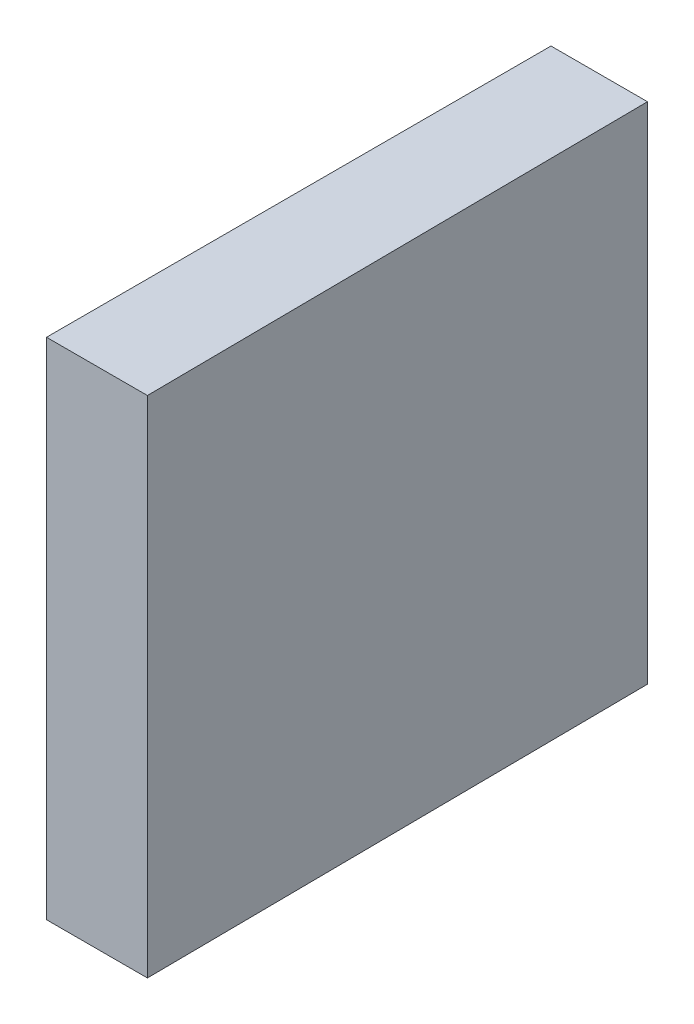
ISO-10303-21;
HEADER;
FILE_DESCRIPTION(('STEP AP214'),'2;1');
FILE_NAME('part.step','',(''),(''),'','','');
FILE_SCHEMA(('AUTOMOTIVE_DESIGN { 1 0 10303 214 1 1 1 1 }'));
ENDSEC;
DATA;
#1=APPLICATION_CONTEXT('core data for automotive mechanical design processes');
#2=APPLICATION_PROTOCOL_DEFINITION('international standard','automotive_design',2000,#1);
#3=PRODUCT_CONTEXT('',#1,'mechanical');
#4=PRODUCT('Part','Part','',(#3));
#5=PRODUCT_RELATED_PRODUCT_CATEGORY('part','',(#4));
#6=PRODUCT_DEFINITION_FORMATION('','',#4);
#7=PRODUCT_DEFINITION_CONTEXT('part definition',#1,'design');
#8=PRODUCT_DEFINITION('design','',#6,#7);
#9=PRODUCT_DEFINITION_SHAPE('','',#8);
#10=(LENGTH_UNIT() NAMED_UNIT(*) SI_UNIT(.MILLI.,.METRE.));
#11=(NAMED_UNIT(*) PLANE_ANGLE_UNIT() SI_UNIT($,.RADIAN.));
#12=(NAMED_UNIT(*) SI_UNIT($,.STERADIAN.) SOLID_ANGLE_UNIT());
#13=UNCERTAINTY_MEASURE_WITH_UNIT(LENGTH_MEASURE(1.E-05),#10,'distance_accuracy_value','');
#14=(GEOMETRIC_REPRESENTATION_CONTEXT(3) GLOBAL_UNCERTAINTY_ASSIGNED_CONTEXT((#13)) GLOBAL_UNIT_ASSIGNED_CONTEXT((#10,
#11,#12)) REPRESENTATION_CONTEXT('',''));
#15=CARTESIAN_POINT('',(0.,0.,0.));
#16=DIRECTION('',(0.,0.,1.));
#17=DIRECTION('',(1.,0.,0.));
#18=AXIS2_PLACEMENT_3D('',#15,#16,#17);
#19=CARTESIAN_POINT('',(0.,25.,-12.5));
#20=DIRECTION('',(0.,0.,1.));
#21=DIRECTION('',(1.,0.,0.));
#22=AXIS2_PLACEMENT_3D('',#19,#20,#21);
#23=PLANE('',#22);
#24=DIRECTION('',(-1.,0.,0.));
#25=VECTOR('',#24,1.);
#26=CARTESIAN_POINT('',(0.,0.,-12.5));
#27=LINE('',#26,#25);
#28=CARTESIAN_POINT('',(4.78182830523121,0.,-12.5));
#29=VERTEX_POINT('',#28);
#30=CARTESIAN_POINT('',(0.,0.,-12.5));
#31=VERTEX_POINT('',#30);
#32=EDGE_CURVE('E96',#29,#31,#27,.T.);
#33=ORIENTED_EDGE('',*,*,#32,.T.);
#34=DIRECTION('',(0.,-1.,0.));
#35=VECTOR('',#34,1.);
#36=CARTESIAN_POINT('',(0.,25.,-12.5));
#37=LINE('',#36,#35);
#38=CARTESIAN_POINT('',(0.,25.,-12.5));
#39=VERTEX_POINT('',#38);
#40=EDGE_CURVE('E11',#39,#31,#37,.T.);
#41=ORIENTED_EDGE('',*,*,#40,.F.);
#42=DIRECTION('',(-1.,0.,0.));
#43=VECTOR('',#42,1.);
#44=CARTESIAN_POINT('',(0.,25.,-12.5));
#45=LINE('',#44,#43);
#46=CARTESIAN_POINT('',(4.78182830523121,25.,-12.5));
#47=VERTEX_POINT('',#46);
#48=EDGE_CURVE('E84',#47,#39,#45,.T.);
#49=ORIENTED_EDGE('',*,*,#48,.F.);
#50=DIRECTION('',(0.,-1.,0.));
#51=VECTOR('',#50,1.);
#52=CARTESIAN_POINT('',(4.78182830523121,25.,-12.5));
#53=LINE('',#52,#51);
#54=EDGE_CURVE('E92',#47,#29,#53,.T.);
#55=ORIENTED_EDGE('',*,*,#54,.T.);
#56=EDGE_LOOP('',(#33,#41,#49,#55));
#57=FACE_BOUND('',#56,.T.);
#58=ADVANCED_FACE('F33',(#57),#23,.F.);
#59=CARTESIAN_POINT('',(0.,25.,-12.5));
#60=DIRECTION('',(1.,0.,0.));
#61=DIRECTION('',(0.,0.,-1.));
#62=AXIS2_PLACEMENT_3D('',#59,#60,#61);
#63=PLANE('',#62);
#64=DIRECTION('',(0.,0.,1.));
#65=VECTOR('',#64,1.);
#66=CARTESIAN_POINT('',(0.,0.,-12.5));
#67=LINE('',#66,#65);
#68=CARTESIAN_POINT('',(0.,0.,12.5));
#69=VERTEX_POINT('',#68);
#70=EDGE_CURVE('E88',#31,#69,#67,.T.);
#71=ORIENTED_EDGE('',*,*,#70,.T.);
#72=DIRECTION('',(0.,-1.,0.));
#73=VECTOR('',#72,1.);
#74=CARTESIAN_POINT('',(0.,25.,12.5));
#75=LINE('',#74,#73);
#76=CARTESIAN_POINT('',(0.,25.,12.5));
#77=VERTEX_POINT('',#76);
#78=EDGE_CURVE('E41',#77,#69,#75,.T.);
#79=ORIENTED_EDGE('',*,*,#78,.F.);
#80=DIRECTION('',(0.,0.,1.));
#81=VECTOR('',#80,1.);
#82=CARTESIAN_POINT('',(0.,25.,-12.5));
#83=LINE('',#82,#81);
#84=EDGE_CURVE('E79',#39,#77,#83,.T.);
#85=ORIENTED_EDGE('',*,*,#84,.F.);
#86=ORIENTED_EDGE('',*,*,#40,.T.);
#87=EDGE_LOOP('',(#71,#79,#85,#86));
#88=FACE_BOUND('',#87,.T.);
#89=ADVANCED_FACE('F87',(#88),#63,.F.);
#90=CARTESIAN_POINT('',(0.,25.,12.5));
#91=DIRECTION('',(0.,0.,-1.));
#92=DIRECTION('',(-1.,0.,0.));
#93=AXIS2_PLACEMENT_3D('',#90,#91,#92);
#94=PLANE('',#93);
#95=DIRECTION('',(1.,0.,0.));
#96=VECTOR('',#95,1.);
#97=CARTESIAN_POINT('',(0.,0.,12.5));
#98=LINE('',#97,#96);
#99=CARTESIAN_POINT('',(5.,0.,12.5));
#100=VERTEX_POINT('',#99);
#101=EDGE_CURVE('E66',#69,#100,#98,.T.);
#102=ORIENTED_EDGE('',*,*,#101,.T.);
#103=DIRECTION('',(0.,-1.,0.));
#104=VECTOR('',#103,1.);
#105=CARTESIAN_POINT('',(5.,25.,12.5));
#106=LINE('',#105,#104);
#107=CARTESIAN_POINT('',(5.,25.,12.5));
#108=VERTEX_POINT('',#107);
#109=EDGE_CURVE('E89',#108,#100,#106,.T.);
#110=ORIENTED_EDGE('',*,*,#109,.F.);
#111=DIRECTION('',(1.,0.,0.));
#112=VECTOR('',#111,1.);
#113=CARTESIAN_POINT('',(0.,25.,12.5));
#114=LINE('',#113,#112);
#115=EDGE_CURVE('E82',#77,#108,#114,.T.);
#116=ORIENTED_EDGE('',*,*,#115,.F.);
#117=ORIENTED_EDGE('',*,*,#78,.T.);
#118=EDGE_LOOP('',(#102,#110,#116,#117));
#119=FACE_BOUND('',#118,.T.);
#120=ADVANCED_FACE('F90',(#119),#94,.F.);
#121=CARTESIAN_POINT('',(5.,25.,12.5));
#122=DIRECTION('',(-0.999961923064171,0.,0.00872653549836698));
#123=DIRECTION('',(0.00872653549836698,0.,0.999961923064171));
#124=AXIS2_PLACEMENT_3D('',#121,#122,#123);
#125=PLANE('',#124);
#126=DIRECTION('',(-0.00872653549836698,0.,-0.999961923064171));
#127=VECTOR('',#126,1.);
#128=CARTESIAN_POINT('',(5.,0.,12.5));
#129=LINE('',#128,#127);
#130=EDGE_CURVE('E72',#100,#29,#129,.T.);
#131=ORIENTED_EDGE('',*,*,#130,.T.);
#132=ORIENTED_EDGE('',*,*,#54,.F.);
#133=DIRECTION('',(-0.00872653549836698,0.,-0.999961923064171));
#134=VECTOR('',#133,1.);
#135=CARTESIAN_POINT('',(5.,25.,12.5));
#136=LINE('',#135,#134);
#137=EDGE_CURVE('E49',#108,#47,#136,.T.);
#138=ORIENTED_EDGE('',*,*,#137,.F.);
#139=ORIENTED_EDGE('',*,*,#109,.T.);
#140=EDGE_LOOP('',(#131,#132,#138,#139));
#141=FACE_BOUND('',#140,.T.);
#142=ADVANCED_FACE('F103',(#141),#125,.F.);
#143=CARTESIAN_POINT('',(0.,25.,0.));
#144=DIRECTION('',(0.,-1.,0.));
#145=DIRECTION('',(0.,0.,-1.));
#146=AXIS2_PLACEMENT_3D('',#143,#144,#145);
#147=PLANE('',#146);
#148=ORIENTED_EDGE('',*,*,#48,.T.);
#149=ORIENTED_EDGE('',*,*,#84,.T.);
#150=ORIENTED_EDGE('',*,*,#115,.T.);
#151=ORIENTED_EDGE('',*,*,#137,.T.);
#152=EDGE_LOOP('',(#148,#149,#150,#151));
#153=FACE_BOUND('',#152,.T.);
#154=ADVANCED_FACE('F80',(#153),#147,.F.);
#155=CARTESIAN_POINT('',(0.,0.,0.));
#156=DIRECTION('',(0.,-1.,0.));
#157=DIRECTION('',(0.,0.,-1.));
#158=AXIS2_PLACEMENT_3D('',#155,#156,#157);
#159=PLANE('',#158);
#160=ORIENTED_EDGE('',*,*,#32,.F.);
#161=ORIENTED_EDGE('',*,*,#130,.F.);
#162=ORIENTED_EDGE('',*,*,#101,.F.);
#163=ORIENTED_EDGE('',*,*,#70,.F.);
#164=EDGE_LOOP('',(#160,#161,#162,#163));
#165=FACE_BOUND('',#164,.T.);
#166=ADVANCED_FACE('F106',(#165),#159,.T.);
#167=CLOSED_SHELL('',(#58,#89,#120,#142,#154,#166));
#168=MANIFOLD_SOLID_BREP('B2',#167);
#169=ADVANCED_BREP_SHAPE_REPRESENTATION('',(#18,#168),#14);
#170=SHAPE_DEFINITION_REPRESENTATION(#9,#169);
ENDSEC;
END-ISO-10303-21;
